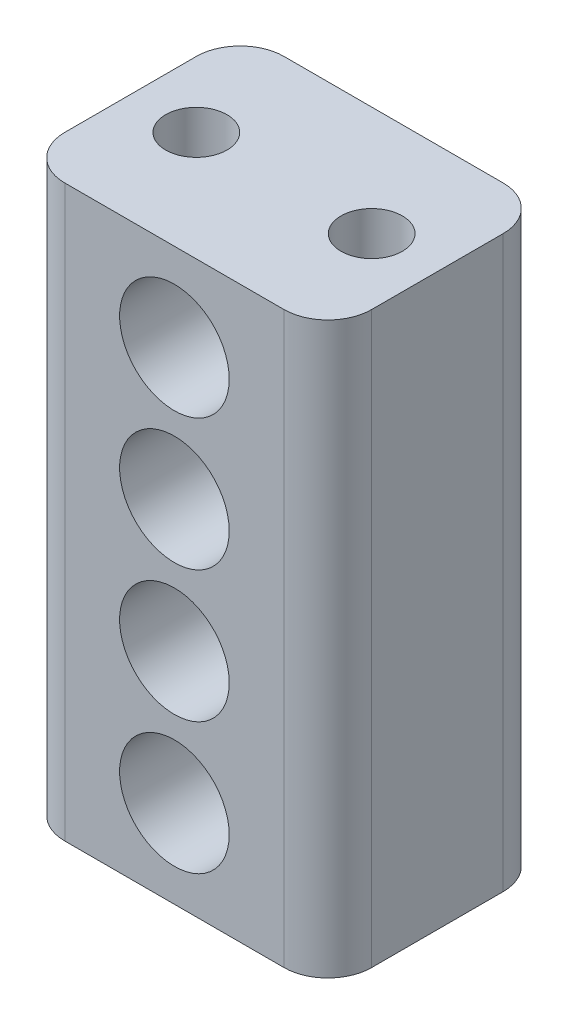
ISO-10303-21;
HEADER;
FILE_DESCRIPTION(('STEP AP214'),'2;1');
FILE_NAME('part.step','',(''),(''),'','','');
FILE_SCHEMA(('AUTOMOTIVE_DESIGN { 1 0 10303 214 1 1 1 1 }'));
ENDSEC;
DATA;
#1=APPLICATION_CONTEXT('core data for automotive mechanical design processes');
#2=APPLICATION_PROTOCOL_DEFINITION('international standard','automotive_design',2000,#1);
#3=PRODUCT_CONTEXT('',#1,'mechanical');
#4=PRODUCT('Part','Part','',(#3));
#5=PRODUCT_RELATED_PRODUCT_CATEGORY('part','',(#4));
#6=PRODUCT_DEFINITION_FORMATION('','',#4);
#7=PRODUCT_DEFINITION_CONTEXT('part definition',#1,'design');
#8=PRODUCT_DEFINITION('design','',#6,#7);
#9=PRODUCT_DEFINITION_SHAPE('','',#8);
#10=(LENGTH_UNIT() NAMED_UNIT(*) SI_UNIT(.MILLI.,.METRE.));
#11=(NAMED_UNIT(*) PLANE_ANGLE_UNIT() SI_UNIT($,.RADIAN.));
#12=(NAMED_UNIT(*) SI_UNIT($,.STERADIAN.) SOLID_ANGLE_UNIT());
#13=UNCERTAINTY_MEASURE_WITH_UNIT(LENGTH_MEASURE(1.E-05),#10,'distance_accuracy_value','');
#14=(GEOMETRIC_REPRESENTATION_CONTEXT(3) GLOBAL_UNCERTAINTY_ASSIGNED_CONTEXT((#13)) GLOBAL_UNIT_ASSIGNED_CONTEXT((#10,
#11,#12)) REPRESENTATION_CONTEXT('',''));
#15=CARTESIAN_POINT('',(0.,0.,0.));
#16=DIRECTION('',(0.,0.,1.));
#17=DIRECTION('',(1.,0.,0.));
#18=AXIS2_PLACEMENT_3D('',#15,#16,#17);
#19=CARTESIAN_POINT('',(3.5,0.,5.));
#20=DIRECTION('',(1.,0.,0.));
#21=DIRECTION('',(0.,0.,-1.));
#22=AXIS2_PLACEMENT_3D('',#19,#20,#21);
#23=PLANE('',#22);
#24=DIRECTION('',(0.,0.,-1.));
#25=VECTOR('',#24,1.);
#26=CARTESIAN_POINT('',(3.5,6.5,5.));
#27=LINE('',#26,#25);
#28=CARTESIAN_POINT('',(3.5,6.5,4.));
#29=VERTEX_POINT('',#28);
#30=CARTESIAN_POINT('',(3.5,6.5,1.));
#31=VERTEX_POINT('',#30);
#32=EDGE_CURVE('E130',#29,#31,#27,.T.);
#33=ORIENTED_EDGE('',*,*,#32,.F.);
#34=DIRECTION('',(0.,-1.,0.));
#35=VECTOR('',#34,1.);
#36=CARTESIAN_POINT('',(3.5,0.,4.));
#37=LINE('',#36,#35);
#38=CARTESIAN_POINT('',(3.5,-6.5,4.));
#39=VERTEX_POINT('',#38);
#40=EDGE_CURVE('E11',#29,#39,#37,.T.);
#41=ORIENTED_EDGE('',*,*,#40,.T.);
#42=DIRECTION('',(0.,0.,-1.));
#43=VECTOR('',#42,1.);
#44=CARTESIAN_POINT('',(3.5,-6.5,5.));
#45=LINE('',#44,#43);
#46=CARTESIAN_POINT('',(3.5,-6.5,1.));
#47=VERTEX_POINT('',#46);
#48=EDGE_CURVE('E125',#39,#47,#45,.T.);
#49=ORIENTED_EDGE('',*,*,#48,.T.);
#50=DIRECTION('',(0.,-1.,0.));
#51=VECTOR('',#50,1.);
#52=CARTESIAN_POINT('',(3.5,6.5,1.));
#53=LINE('',#52,#51);
#54=EDGE_CURVE('E45',#47,#31,#53,.F.);
#55=ORIENTED_EDGE('',*,*,#54,.T.);
#56=EDGE_LOOP('',(#33,#41,#49,#55));
#57=FACE_BOUND('',#56,.T.);
#58=ADVANCED_FACE('F37',(#57),#23,.T.);
#59=CARTESIAN_POINT('',(0.,6.5,5.));
#60=DIRECTION('',(0.,1.,0.));
#61=DIRECTION('',(0.,0.,1.));
#62=AXIS2_PLACEMENT_3D('',#59,#60,#61);
#63=PLANE('',#62);
#64=CARTESIAN_POINT('',(-2.,6.5,2.5));
#65=DIRECTION('',(0.,1.,0.));
#66=DIRECTION('',(0.,0.,1.));
#67=AXIS2_PLACEMENT_3D('',#64,#65,#66);
#68=CIRCLE('',#67,0.7);
#69=CARTESIAN_POINT('',(-2.,6.5,3.2));
#70=VERTEX_POINT('',#69);
#71=EDGE_CURVE('E411',#70,#70,#68,.T.);
#72=ORIENTED_EDGE('',*,*,#71,.F.);
#73=EDGE_LOOP('',(#72));
#74=FACE_BOUND('',#73,.T.);
#75=CARTESIAN_POINT('',(2.,6.5,2.5));
#76=DIRECTION('',(0.,1.,0.));
#77=DIRECTION('',(0.,0.,1.));
#78=AXIS2_PLACEMENT_3D('',#75,#76,#77);
#79=CIRCLE('',#78,0.7);
#80=CARTESIAN_POINT('',(2.,6.5,3.2));
#81=VERTEX_POINT('',#80);
#82=EDGE_CURVE('E394',#81,#81,#79,.T.);
#83=ORIENTED_EDGE('',*,*,#82,.F.);
#84=EDGE_LOOP('',(#83));
#85=FACE_BOUND('',#84,.T.);
#86=DIRECTION('',(1.,0.,0.));
#87=VECTOR('',#86,1.);
#88=CARTESIAN_POINT('',(0.,6.5,0.));
#89=LINE('',#88,#87);
#90=CARTESIAN_POINT('',(-2.5,6.5,0.));
#91=VERTEX_POINT('',#90);
#92=CARTESIAN_POINT('',(2.5,6.5,0.));
#93=VERTEX_POINT('',#92);
#94=EDGE_CURVE('E180',#91,#93,#89,.T.);
#95=ORIENTED_EDGE('',*,*,#94,.F.);
#96=CARTESIAN_POINT('',(-2.5,6.5,1.));
#97=DIRECTION('',(0.,1.,0.));
#98=DIRECTION('',(0.,0.,1.));
#99=AXIS2_PLACEMENT_3D('',#96,#97,#98);
#100=CIRCLE('',#99,1.);
#101=CARTESIAN_POINT('',(-3.5,6.5,1.));
#102=VERTEX_POINT('',#101);
#103=EDGE_CURVE('E149',#91,#102,#100,.T.);
#104=ORIENTED_EDGE('',*,*,#103,.T.);
#105=DIRECTION('',(0.,0.,-1.));
#106=VECTOR('',#105,1.);
#107=CARTESIAN_POINT('',(-3.5,6.5,5.));
#108=LINE('',#107,#106);
#109=CARTESIAN_POINT('',(-3.5,6.5,4.));
#110=VERTEX_POINT('',#109);
#111=EDGE_CURVE('E124',#110,#102,#108,.T.);
#112=ORIENTED_EDGE('',*,*,#111,.F.);
#113=CARTESIAN_POINT('',(-2.5,6.5,4.));
#114=DIRECTION('',(0.,1.,0.));
#115=DIRECTION('',(0.,0.,1.));
#116=AXIS2_PLACEMENT_3D('',#113,#114,#115);
#117=CIRCLE('',#116,1.);
#118=CARTESIAN_POINT('',(-2.5,6.5,5.));
#119=VERTEX_POINT('',#118);
#120=EDGE_CURVE('E129',#110,#119,#117,.T.);
#121=ORIENTED_EDGE('',*,*,#120,.T.);
#122=DIRECTION('',(1.,0.,0.));
#123=VECTOR('',#122,1.);
#124=CARTESIAN_POINT('',(0.,6.5,5.));
#125=LINE('',#124,#123);
#126=CARTESIAN_POINT('',(2.5,6.5,5.));
#127=VERTEX_POINT('',#126);
#128=EDGE_CURVE('E158',#119,#127,#125,.T.);
#129=ORIENTED_EDGE('',*,*,#128,.T.);
#130=CARTESIAN_POINT('',(2.5,6.5,4.));
#131=DIRECTION('',(0.,1.,0.));
#132=DIRECTION('',(0.,0.,1.));
#133=AXIS2_PLACEMENT_3D('',#130,#131,#132);
#134=CIRCLE('',#133,1.);
#135=EDGE_CURVE('E58',#127,#29,#134,.T.);
#136=ORIENTED_EDGE('',*,*,#135,.T.);
#137=ORIENTED_EDGE('',*,*,#32,.T.);
#138=CARTESIAN_POINT('',(2.5,6.5,1.));
#139=DIRECTION('',(0.,1.,0.));
#140=DIRECTION('',(0.,0.,1.));
#141=AXIS2_PLACEMENT_3D('',#138,#139,#140);
#142=CIRCLE('',#141,1.);
#143=EDGE_CURVE('E145',#31,#93,#142,.T.);
#144=ORIENTED_EDGE('',*,*,#143,.T.);
#145=EDGE_LOOP('',(#95,#104,#112,#121,#129,#136,#137,#144));
#146=FACE_BOUND('',#145,.T.);
#147=ADVANCED_FACE('F210',(#74,#85,#146),#63,.T.);
#148=CARTESIAN_POINT('',(-3.5,0.,5.));
#149=DIRECTION('',(1.,0.,0.));
#150=DIRECTION('',(0.,0.,-1.));
#151=AXIS2_PLACEMENT_3D('',#148,#149,#150);
#152=PLANE('',#151);
#153=ORIENTED_EDGE('',*,*,#111,.T.);
#154=DIRECTION('',(0.,-1.,0.));
#155=VECTOR('',#154,1.);
#156=CARTESIAN_POINT('',(-3.5,0.,1.));
#157=LINE('',#156,#155);
#158=CARTESIAN_POINT('',(-3.5,-6.5,1.));
#159=VERTEX_POINT('',#158);
#160=EDGE_CURVE('E123',#102,#159,#157,.T.);
#161=ORIENTED_EDGE('',*,*,#160,.T.);
#162=DIRECTION('',(0.,0.,-1.));
#163=VECTOR('',#162,1.);
#164=CARTESIAN_POINT('',(-3.5,-6.5,5.));
#165=LINE('',#164,#163);
#166=CARTESIAN_POINT('',(-3.5,-6.5,4.));
#167=VERTEX_POINT('',#166);
#168=EDGE_CURVE('E106',#167,#159,#165,.T.);
#169=ORIENTED_EDGE('',*,*,#168,.F.);
#170=DIRECTION('',(0.,-1.,0.));
#171=VECTOR('',#170,1.);
#172=CARTESIAN_POINT('',(-3.5,6.5,4.));
#173=LINE('',#172,#171);
#174=EDGE_CURVE('E120',#167,#110,#173,.F.);
#175=ORIENTED_EDGE('',*,*,#174,.T.);
#176=EDGE_LOOP('',(#153,#161,#169,#175));
#177=FACE_BOUND('',#176,.T.);
#178=ADVANCED_FACE('F119',(#177),#152,.F.);
#179=CARTESIAN_POINT('',(0.,4.5,5.));
#180=DIRECTION('',(0.,0.,-1.));
#181=DIRECTION('',(-1.,0.,0.));
#182=AXIS2_PLACEMENT_3D('',#179,#180,#181);
#183=CYLINDRICAL_SURFACE('',#182,1.25);
#184=CARTESIAN_POINT('',(0.,4.5,5.));
#185=DIRECTION('',(0.,0.,1.));
#186=DIRECTION('',(1.,0.,0.));
#187=AXIS2_PLACEMENT_3D('',#184,#185,#186);
#188=CIRCLE('',#187,1.25);
#189=CARTESIAN_POINT('',(1.25,4.5,5.));
#190=VERTEX_POINT('',#189);
#191=EDGE_CURVE('E159',#190,#190,#188,.T.);
#192=ORIENTED_EDGE('',*,*,#191,.T.);
#193=EDGE_LOOP('',(#192));
#194=FACE_BOUND('',#193,.T.);
#195=CARTESIAN_POINT('',(0.,4.5,0.));
#196=DIRECTION('',(0.,0.,1.));
#197=DIRECTION('',(1.,0.,0.));
#198=AXIS2_PLACEMENT_3D('',#195,#196,#197);
#199=CIRCLE('',#198,1.25);
#200=CARTESIAN_POINT('',(1.25,4.5,0.));
#201=VERTEX_POINT('',#200);
#202=EDGE_CURVE('E177',#201,#201,#199,.T.);
#203=ORIENTED_EDGE('',*,*,#202,.F.);
#204=EDGE_LOOP('',(#203));
#205=FACE_BOUND('',#204,.T.);
#206=ADVANCED_FACE('F219',(#194,#205),#183,.F.);
#207=CARTESIAN_POINT('',(0.,1.5,5.));
#208=DIRECTION('',(0.,0.,-1.));
#209=DIRECTION('',(-1.,0.,0.));
#210=AXIS2_PLACEMENT_3D('',#207,#208,#209);
#211=CYLINDRICAL_SURFACE('',#210,1.25);
#212=CARTESIAN_POINT('',(0.,1.5,5.));
#213=DIRECTION('',(0.,0.,1.));
#214=DIRECTION('',(1.,0.,0.));
#215=AXIS2_PLACEMENT_3D('',#212,#213,#214);
#216=CIRCLE('',#215,1.25);
#217=CARTESIAN_POINT('',(1.25000000000003,1.5,5.));
#218=VERTEX_POINT('',#217);
#219=EDGE_CURVE('E163',#218,#218,#216,.T.);
#220=ORIENTED_EDGE('',*,*,#219,.T.);
#221=EDGE_LOOP('',(#220));
#222=FACE_BOUND('',#221,.T.);
#223=CARTESIAN_POINT('',(0.,1.5,0.));
#224=DIRECTION('',(0.,0.,1.));
#225=DIRECTION('',(1.,0.,0.));
#226=AXIS2_PLACEMENT_3D('',#223,#224,#225);
#227=CIRCLE('',#226,1.25);
#228=CARTESIAN_POINT('',(1.25000000000003,1.5,0.));
#229=VERTEX_POINT('',#228);
#230=EDGE_CURVE('E174',#229,#229,#227,.T.);
#231=ORIENTED_EDGE('',*,*,#230,.F.);
#232=EDGE_LOOP('',(#231));
#233=FACE_BOUND('',#232,.T.);
#234=ADVANCED_FACE('F222',(#222,#233),#211,.F.);
#235=CARTESIAN_POINT('',(0.,-1.5,5.));
#236=DIRECTION('',(0.,0.,-1.));
#237=DIRECTION('',(-1.,0.,0.));
#238=AXIS2_PLACEMENT_3D('',#235,#236,#237);
#239=CYLINDRICAL_SURFACE('',#238,1.25);
#240=CARTESIAN_POINT('',(0.,-1.5,5.));
#241=DIRECTION('',(0.,0.,1.));
#242=DIRECTION('',(1.,0.,0.));
#243=AXIS2_PLACEMENT_3D('',#240,#241,#242);
#244=CIRCLE('',#243,1.25);
#245=CARTESIAN_POINT('',(1.25000000000006,-1.5,5.));
#246=VERTEX_POINT('',#245);
#247=EDGE_CURVE('E418',#246,#246,#244,.T.);
#248=ORIENTED_EDGE('',*,*,#247,.T.);
#249=EDGE_LOOP('',(#248));
#250=FACE_BOUND('',#249,.T.);
#251=CARTESIAN_POINT('',(0.,-1.5,0.));
#252=DIRECTION('',(0.,0.,1.));
#253=DIRECTION('',(1.,0.,0.));
#254=AXIS2_PLACEMENT_3D('',#251,#252,#253);
#255=CIRCLE('',#254,1.25);
#256=CARTESIAN_POINT('',(1.25000000000006,-1.5,0.));
#257=VERTEX_POINT('',#256);
#258=EDGE_CURVE('E170',#257,#257,#255,.T.);
#259=ORIENTED_EDGE('',*,*,#258,.F.);
#260=EDGE_LOOP('',(#259));
#261=FACE_BOUND('',#260,.T.);
#262=ADVANCED_FACE('F226',(#250,#261),#239,.F.);
#263=CARTESIAN_POINT('',(0.,-4.5,5.));
#264=DIRECTION('',(0.,0.,-1.));
#265=DIRECTION('',(-1.,0.,0.));
#266=AXIS2_PLACEMENT_3D('',#263,#264,#265);
#267=CYLINDRICAL_SURFACE('',#266,1.25);
#268=CARTESIAN_POINT('',(0.,-4.5,5.));
#269=DIRECTION('',(0.,0.,1.));
#270=DIRECTION('',(1.,0.,0.));
#271=AXIS2_PLACEMENT_3D('',#268,#269,#270);
#272=CIRCLE('',#271,1.25);
#273=CARTESIAN_POINT('',(1.2500000000001,-4.5,5.));
#274=VERTEX_POINT('',#273);
#275=EDGE_CURVE('E186',#274,#274,#272,.T.);
#276=ORIENTED_EDGE('',*,*,#275,.T.);
#277=EDGE_LOOP('',(#276));
#278=FACE_BOUND('',#277,.T.);
#279=CARTESIAN_POINT('',(0.,-4.5,0.));
#280=DIRECTION('',(0.,0.,1.));
#281=DIRECTION('',(1.,0.,0.));
#282=AXIS2_PLACEMENT_3D('',#279,#280,#281);
#283=CIRCLE('',#282,1.25);
#284=CARTESIAN_POINT('',(1.2500000000001,-4.5,0.));
#285=VERTEX_POINT('',#284);
#286=EDGE_CURVE('E167',#285,#285,#283,.T.);
#287=ORIENTED_EDGE('',*,*,#286,.F.);
#288=EDGE_LOOP('',(#287));
#289=FACE_BOUND('',#288,.T.);
#290=ADVANCED_FACE('F230',(#278,#289),#267,.F.);
#291=CARTESIAN_POINT('',(0.,-6.5,5.));
#292=DIRECTION('',(0.,1.,0.));
#293=DIRECTION('',(0.,0.,1.));
#294=AXIS2_PLACEMENT_3D('',#291,#292,#293);
#295=PLANE('',#294);
#296=CARTESIAN_POINT('',(-2.,-6.5,2.5));
#297=DIRECTION('',(0.,1.,0.));
#298=DIRECTION('',(0.,0.,1.));
#299=AXIS2_PLACEMENT_3D('',#296,#297,#298);
#300=CIRCLE('',#299,0.7);
#301=CARTESIAN_POINT('',(-2.,-6.5,3.2));
#302=VERTEX_POINT('',#301);
#303=EDGE_CURVE('E395',#302,#302,#300,.T.);
#304=ORIENTED_EDGE('',*,*,#303,.T.);
#305=EDGE_LOOP('',(#304));
#306=FACE_BOUND('',#305,.T.);
#307=CARTESIAN_POINT('',(2.,-6.5,2.5));
#308=DIRECTION('',(0.,1.,0.));
#309=DIRECTION('',(0.,0.,1.));
#310=AXIS2_PLACEMENT_3D('',#307,#308,#309);
#311=CIRCLE('',#310,0.7);
#312=CARTESIAN_POINT('',(2.,-6.5,3.2));
#313=VERTEX_POINT('',#312);
#314=EDGE_CURVE('E406',#313,#313,#311,.T.);
#315=ORIENTED_EDGE('',*,*,#314,.T.);
#316=EDGE_LOOP('',(#315));
#317=FACE_BOUND('',#316,.T.);
#318=ORIENTED_EDGE('',*,*,#168,.T.);
#319=CARTESIAN_POINT('',(-2.5,-6.5,1.));
#320=DIRECTION('',(0.,1.,0.));
#321=DIRECTION('',(0.,0.,1.));
#322=AXIS2_PLACEMENT_3D('',#319,#320,#321);
#323=CIRCLE('',#322,1.);
#324=CARTESIAN_POINT('',(-2.5,-6.5,0.));
#325=VERTEX_POINT('',#324);
#326=EDGE_CURVE('E113',#159,#325,#323,.F.);
#327=ORIENTED_EDGE('',*,*,#326,.T.);
#328=DIRECTION('',(1.,0.,0.));
#329=VECTOR('',#328,1.);
#330=CARTESIAN_POINT('',(0.,-6.5,0.));
#331=LINE('',#330,#329);
#332=CARTESIAN_POINT('',(2.5,-6.5,0.));
#333=VERTEX_POINT('',#332);
#334=EDGE_CURVE('E183',#325,#333,#331,.T.);
#335=ORIENTED_EDGE('',*,*,#334,.T.);
#336=CARTESIAN_POINT('',(2.5,-6.5,1.));
#337=DIRECTION('',(0.,1.,0.));
#338=DIRECTION('',(0.,0.,1.));
#339=AXIS2_PLACEMENT_3D('',#336,#337,#338);
#340=CIRCLE('',#339,1.);
#341=EDGE_CURVE('E132',#333,#47,#340,.F.);
#342=ORIENTED_EDGE('',*,*,#341,.T.);
#343=ORIENTED_EDGE('',*,*,#48,.F.);
#344=CARTESIAN_POINT('',(2.5,-6.5,4.));
#345=DIRECTION('',(0.,1.,0.));
#346=DIRECTION('',(0.,0.,1.));
#347=AXIS2_PLACEMENT_3D('',#344,#345,#346);
#348=CIRCLE('',#347,1.);
#349=CARTESIAN_POINT('',(2.5,-6.5,5.));
#350=VERTEX_POINT('',#349);
#351=EDGE_CURVE('E114',#39,#350,#348,.F.);
#352=ORIENTED_EDGE('',*,*,#351,.T.);
#353=DIRECTION('',(1.,0.,0.));
#354=VECTOR('',#353,1.);
#355=CARTESIAN_POINT('',(0.,-6.5,5.));
#356=LINE('',#355,#354);
#357=CARTESIAN_POINT('',(-2.5,-6.5,5.));
#358=VERTEX_POINT('',#357);
#359=EDGE_CURVE('E108',#358,#350,#356,.T.);
#360=ORIENTED_EDGE('',*,*,#359,.F.);
#361=CARTESIAN_POINT('',(-2.5,-6.5,4.));
#362=DIRECTION('',(0.,1.,0.));
#363=DIRECTION('',(0.,0.,1.));
#364=AXIS2_PLACEMENT_3D('',#361,#362,#363);
#365=CIRCLE('',#364,1.);
#366=EDGE_CURVE('E103',#358,#167,#365,.F.);
#367=ORIENTED_EDGE('',*,*,#366,.T.);
#368=EDGE_LOOP('',(#318,#327,#335,#342,#343,#352,#360,#367));
#369=FACE_BOUND('',#368,.T.);
#370=ADVANCED_FACE('F105',(#306,#317,#369),#295,.F.);
#371=CARTESIAN_POINT('',(0.,0.,5.));
#372=DIRECTION('',(0.,0.,1.));
#373=DIRECTION('',(1.,0.,0.));
#374=AXIS2_PLACEMENT_3D('',#371,#372,#373);
#375=PLANE('',#374);
#376=ORIENTED_EDGE('',*,*,#275,.F.);
#377=EDGE_LOOP('',(#376));
#378=FACE_BOUND('',#377,.T.);
#379=ORIENTED_EDGE('',*,*,#247,.F.);
#380=EDGE_LOOP('',(#379));
#381=FACE_BOUND('',#380,.T.);
#382=ORIENTED_EDGE('',*,*,#219,.F.);
#383=EDGE_LOOP('',(#382));
#384=FACE_BOUND('',#383,.T.);
#385=ORIENTED_EDGE('',*,*,#191,.F.);
#386=EDGE_LOOP('',(#385));
#387=FACE_BOUND('',#386,.T.);
#388=ORIENTED_EDGE('',*,*,#128,.F.);
#389=DIRECTION('',(0.,-1.,0.));
#390=VECTOR('',#389,1.);
#391=CARTESIAN_POINT('',(-2.5,-6.5,5.));
#392=LINE('',#391,#390);
#393=EDGE_CURVE('E153',#119,#358,#392,.T.);
#394=ORIENTED_EDGE('',*,*,#393,.T.);
#395=ORIENTED_EDGE('',*,*,#359,.T.);
#396=DIRECTION('',(0.,-1.,0.));
#397=VECTOR('',#396,1.);
#398=CARTESIAN_POINT('',(2.5,0.,5.));
#399=LINE('',#398,#397);
#400=EDGE_CURVE('E151',#350,#127,#399,.F.);
#401=ORIENTED_EDGE('',*,*,#400,.T.);
#402=EDGE_LOOP('',(#388,#394,#395,#401));
#403=FACE_BOUND('',#402,.T.);
#404=ADVANCED_FACE('F156',(#378,#381,#384,#387,#403),#375,.T.);
#405=CARTESIAN_POINT('',(0.,0.,0.));
#406=DIRECTION('',(0.,0.,1.));
#407=DIRECTION('',(1.,0.,0.));
#408=AXIS2_PLACEMENT_3D('',#405,#406,#407);
#409=PLANE('',#408);
#410=ORIENTED_EDGE('',*,*,#286,.T.);
#411=EDGE_LOOP('',(#410));
#412=FACE_BOUND('',#411,.T.);
#413=ORIENTED_EDGE('',*,*,#258,.T.);
#414=EDGE_LOOP('',(#413));
#415=FACE_BOUND('',#414,.T.);
#416=ORIENTED_EDGE('',*,*,#230,.T.);
#417=EDGE_LOOP('',(#416));
#418=FACE_BOUND('',#417,.T.);
#419=ORIENTED_EDGE('',*,*,#202,.T.);
#420=EDGE_LOOP('',(#419));
#421=FACE_BOUND('',#420,.T.);
#422=ORIENTED_EDGE('',*,*,#334,.F.);
#423=DIRECTION('',(0.,-1.,0.));
#424=VECTOR('',#423,1.);
#425=CARTESIAN_POINT('',(-2.5,0.,0.));
#426=LINE('',#425,#424);
#427=EDGE_CURVE('E143',#325,#91,#426,.F.);
#428=ORIENTED_EDGE('',*,*,#427,.T.);
#429=ORIENTED_EDGE('',*,*,#94,.T.);
#430=DIRECTION('',(0.,-1.,0.));
#431=VECTOR('',#430,1.);
#432=CARTESIAN_POINT('',(2.5,-6.5,0.));
#433=LINE('',#432,#431);
#434=EDGE_CURVE('E140',#93,#333,#433,.T.);
#435=ORIENTED_EDGE('',*,*,#434,.T.);
#436=EDGE_LOOP('',(#422,#428,#429,#435));
#437=FACE_BOUND('',#436,.T.);
#438=ADVANCED_FACE('F193',(#412,#415,#418,#421,#437),#409,.F.);
#439=CARTESIAN_POINT('',(-2.5,0.,1.));
#440=DIRECTION('',(0.,-1.,0.));
#441=DIRECTION('',(0.,0.,-1.));
#442=AXIS2_PLACEMENT_3D('',#439,#440,#441);
#443=CYLINDRICAL_SURFACE('',#442,1.);
#444=ORIENTED_EDGE('',*,*,#103,.F.);
#445=ORIENTED_EDGE('',*,*,#427,.F.);
#446=ORIENTED_EDGE('',*,*,#326,.F.);
#447=ORIENTED_EDGE('',*,*,#160,.F.);
#448=EDGE_LOOP('',(#444,#445,#446,#447));
#449=FACE_BOUND('',#448,.T.);
#450=ADVANCED_FACE('F189',(#449),#443,.T.);
#451=CARTESIAN_POINT('',(-2.5,0.,4.));
#452=DIRECTION('',(0.,1.,0.));
#453=DIRECTION('',(0.,0.,1.));
#454=AXIS2_PLACEMENT_3D('',#451,#452,#453);
#455=CYLINDRICAL_SURFACE('',#454,1.);
#456=ORIENTED_EDGE('',*,*,#120,.F.);
#457=ORIENTED_EDGE('',*,*,#174,.F.);
#458=ORIENTED_EDGE('',*,*,#366,.F.);
#459=ORIENTED_EDGE('',*,*,#393,.F.);
#460=EDGE_LOOP('',(#456,#457,#458,#459));
#461=FACE_BOUND('',#460,.T.);
#462=ADVANCED_FACE('F128',(#461),#455,.T.);
#463=CARTESIAN_POINT('',(2.5,0.,4.));
#464=DIRECTION('',(0.,-1.,0.));
#465=DIRECTION('',(0.,0.,-1.));
#466=AXIS2_PLACEMENT_3D('',#463,#464,#465);
#467=CYLINDRICAL_SURFACE('',#466,1.);
#468=ORIENTED_EDGE('',*,*,#135,.F.);
#469=ORIENTED_EDGE('',*,*,#400,.F.);
#470=ORIENTED_EDGE('',*,*,#351,.F.);
#471=ORIENTED_EDGE('',*,*,#40,.F.);
#472=EDGE_LOOP('',(#468,#469,#470,#471));
#473=FACE_BOUND('',#472,.T.);
#474=ADVANCED_FACE('F201',(#473),#467,.T.);
#475=CARTESIAN_POINT('',(2.5,0.,1.));
#476=DIRECTION('',(0.,1.,0.));
#477=DIRECTION('',(0.,0.,1.));
#478=AXIS2_PLACEMENT_3D('',#475,#476,#477);
#479=CYLINDRICAL_SURFACE('',#478,1.);
#480=ORIENTED_EDGE('',*,*,#143,.F.);
#481=ORIENTED_EDGE('',*,*,#54,.F.);
#482=ORIENTED_EDGE('',*,*,#341,.F.);
#483=ORIENTED_EDGE('',*,*,#434,.F.);
#484=EDGE_LOOP('',(#480,#481,#482,#483));
#485=FACE_BOUND('',#484,.T.);
#486=ADVANCED_FACE('F39',(#485),#479,.T.);
#487=CARTESIAN_POINT('',(2.,3.5,2.5));
#488=DIRECTION('',(0.,1.,0.));
#489=DIRECTION('',(0.,0.,1.));
#490=AXIS2_PLACEMENT_3D('',#487,#488,#489);
#491=CYLINDRICAL_SURFACE('',#490,0.7);
#492=CARTESIAN_POINT('',(2.,3.5,2.5));
#493=DIRECTION('',(0.,1.,0.));
#494=DIRECTION('',(0.,0.,1.));
#495=AXIS2_PLACEMENT_3D('',#492,#493,#494);
#496=CIRCLE('',#495,0.7);
#497=CARTESIAN_POINT('',(2.,3.5,3.2));
#498=VERTEX_POINT('',#497);
#499=EDGE_CURVE('E398',#498,#498,#496,.T.);
#500=ORIENTED_EDGE('',*,*,#499,.F.);
#501=EDGE_LOOP('',(#500));
#502=FACE_BOUND('',#501,.T.);
#503=ORIENTED_EDGE('',*,*,#82,.T.);
#504=EDGE_LOOP('',(#503));
#505=FACE_BOUND('',#504,.T.);
#506=ADVANCED_FACE('F207',(#502,#505),#491,.F.);
#507=CARTESIAN_POINT('',(2.,3.5,2.5));
#508=DIRECTION('',(0.,1.,0.));
#509=DIRECTION('',(0.,0.,1.));
#510=AXIS2_PLACEMENT_3D('',#507,#508,#509);
#511=PLANE('',#510);
#512=ORIENTED_EDGE('',*,*,#499,.T.);
#513=EDGE_LOOP('',(#512));
#514=FACE_BOUND('',#513,.T.);
#515=ADVANCED_FACE('F320',(#514),#511,.T.);
#516=CARTESIAN_POINT('',(-2.,3.5,2.5));
#517=DIRECTION('',(0.,1.,0.));
#518=DIRECTION('',(0.,0.,1.));
#519=AXIS2_PLACEMENT_3D('',#516,#517,#518);
#520=CYLINDRICAL_SURFACE('',#519,0.7);
#521=CARTESIAN_POINT('',(-2.,3.5,2.5));
#522=DIRECTION('',(0.,1.,0.));
#523=DIRECTION('',(0.,0.,1.));
#524=AXIS2_PLACEMENT_3D('',#521,#522,#523);
#525=CIRCLE('',#524,0.7);
#526=CARTESIAN_POINT('',(-2.,3.5,3.2));
#527=VERTEX_POINT('',#526);
#528=EDGE_CURVE('E171',#527,#527,#525,.T.);
#529=ORIENTED_EDGE('',*,*,#528,.F.);
#530=EDGE_LOOP('',(#529));
#531=FACE_BOUND('',#530,.T.);
#532=ORIENTED_EDGE('',*,*,#71,.T.);
#533=EDGE_LOOP('',(#532));
#534=FACE_BOUND('',#533,.T.);
#535=ADVANCED_FACE('F329',(#531,#534),#520,.F.);
#536=CARTESIAN_POINT('',(-2.,3.5,2.5));
#537=DIRECTION('',(0.,1.,0.));
#538=DIRECTION('',(0.,0.,1.));
#539=AXIS2_PLACEMENT_3D('',#536,#537,#538);
#540=PLANE('',#539);
#541=ORIENTED_EDGE('',*,*,#528,.T.);
#542=EDGE_LOOP('',(#541));
#543=FACE_BOUND('',#542,.T.);
#544=ADVANCED_FACE('F338',(#543),#540,.T.);
#545=CARTESIAN_POINT('',(2.,-3.5,2.5));
#546=DIRECTION('',(0.,-1.,0.));
#547=DIRECTION('',(0.,0.,-1.));
#548=AXIS2_PLACEMENT_3D('',#545,#546,#547);
#549=CYLINDRICAL_SURFACE('',#548,0.7);
#550=CARTESIAN_POINT('',(2.,-3.5,2.5));
#551=DIRECTION('',(0.,1.,0.));
#552=DIRECTION('',(0.,0.,1.));
#553=AXIS2_PLACEMENT_3D('',#550,#551,#552);
#554=CIRCLE('',#553,0.7);
#555=CARTESIAN_POINT('',(2.,-3.5,3.2));
#556=VERTEX_POINT('',#555);
#557=EDGE_CURVE('E401',#556,#556,#554,.T.);
#558=ORIENTED_EDGE('',*,*,#557,.T.);
#559=EDGE_LOOP('',(#558));
#560=FACE_BOUND('',#559,.T.);
#561=ORIENTED_EDGE('',*,*,#314,.F.);
#562=EDGE_LOOP('',(#561));
#563=FACE_BOUND('',#562,.T.);
#564=ADVANCED_FACE('F347',(#560,#563),#549,.F.);
#565=CARTESIAN_POINT('',(2.,-3.5,2.5));
#566=DIRECTION('',(0.,-1.,0.));
#567=DIRECTION('',(0.,0.,1.));
#568=AXIS2_PLACEMENT_3D('',#565,#566,#567);
#569=PLANE('',#568);
#570=ORIENTED_EDGE('',*,*,#557,.F.);
#571=EDGE_LOOP('',(#570));
#572=FACE_BOUND('',#571,.T.);
#573=ADVANCED_FACE('F357',(#572),#569,.T.);
#574=CARTESIAN_POINT('',(-2.,-3.5,2.5));
#575=DIRECTION('',(0.,-1.,0.));
#576=DIRECTION('',(0.,0.,-1.));
#577=AXIS2_PLACEMENT_3D('',#574,#575,#576);
#578=CYLINDRICAL_SURFACE('',#577,0.7);
#579=CARTESIAN_POINT('',(-2.,-3.5,2.5));
#580=DIRECTION('',(0.,1.,0.));
#581=DIRECTION('',(0.,0.,1.));
#582=AXIS2_PLACEMENT_3D('',#579,#580,#581);
#583=CIRCLE('',#582,0.7);
#584=CARTESIAN_POINT('',(-2.,-3.5,3.2));
#585=VERTEX_POINT('',#584);
#586=EDGE_CURVE('E393',#585,#585,#583,.T.);
#587=ORIENTED_EDGE('',*,*,#586,.T.);
#588=EDGE_LOOP('',(#587));
#589=FACE_BOUND('',#588,.T.);
#590=ORIENTED_EDGE('',*,*,#303,.F.);
#591=EDGE_LOOP('',(#590));
#592=FACE_BOUND('',#591,.T.);
#593=ADVANCED_FACE('F364',(#589,#592),#578,.F.);
#594=CARTESIAN_POINT('',(-2.,-3.5,2.5));
#595=DIRECTION('',(0.,-1.,0.));
#596=DIRECTION('',(0.,0.,1.));
#597=AXIS2_PLACEMENT_3D('',#594,#595,#596);
#598=PLANE('',#597);
#599=ORIENTED_EDGE('',*,*,#586,.F.);
#600=EDGE_LOOP('',(#599));
#601=FACE_BOUND('',#600,.T.);
#602=ADVANCED_FACE('F372',(#601),#598,.T.);
#603=CLOSED_SHELL('',(#58,#147,#178,#206,#234,#262,#290,#370,#404,#438,#450,#462,#474,#486,#506,
#515,#535,#544,#564,#573,#593,#602));
#604=MANIFOLD_SOLID_BREP('B2',#603);
#605=ADVANCED_BREP_SHAPE_REPRESENTATION('',(#18,#604),#14);
#606=SHAPE_DEFINITION_REPRESENTATION(#9,#605);
ENDSEC;
END-ISO-10303-21;
